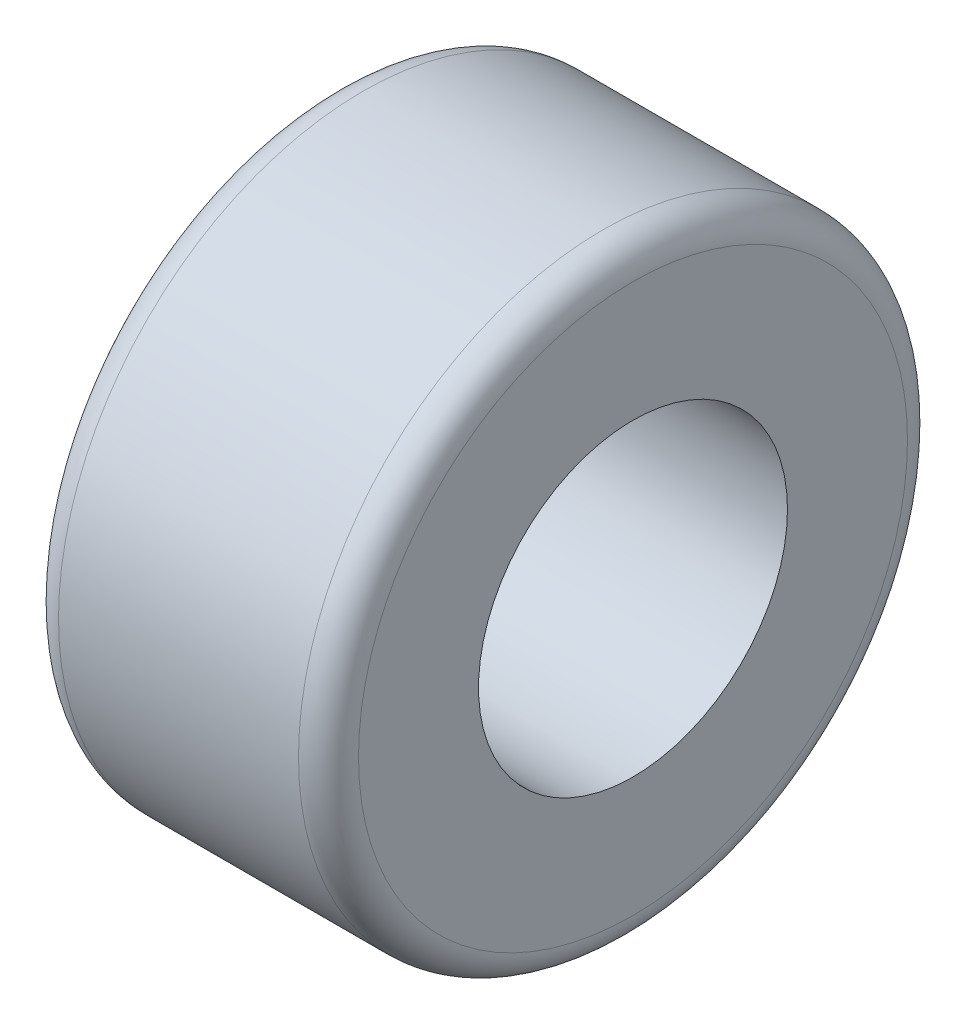
ISO-10303-21;
HEADER;
FILE_DESCRIPTION(('STEP AP214'),'2;1');
FILE_NAME('part.step','',(''),(''),'','','');
FILE_SCHEMA(('AUTOMOTIVE_DESIGN { 1 0 10303 214 1 1 1 1 }'));
ENDSEC;
DATA;
#1=APPLICATION_CONTEXT('core data for automotive mechanical design processes');
#2=APPLICATION_PROTOCOL_DEFINITION('international standard','automotive_design',2000,#1);
#3=PRODUCT_CONTEXT('',#1,'mechanical');
#4=PRODUCT('Part','Part','',(#3));
#5=PRODUCT_RELATED_PRODUCT_CATEGORY('part','',(#4));
#6=PRODUCT_DEFINITION_FORMATION('','',#4);
#7=PRODUCT_DEFINITION_CONTEXT('part definition',#1,'design');
#8=PRODUCT_DEFINITION('design','',#6,#7);
#9=PRODUCT_DEFINITION_SHAPE('','',#8);
#10=(LENGTH_UNIT() NAMED_UNIT(*) SI_UNIT(.MILLI.,.METRE.));
#11=(NAMED_UNIT(*) PLANE_ANGLE_UNIT() SI_UNIT($,.RADIAN.));
#12=(NAMED_UNIT(*) SI_UNIT($,.STERADIAN.) SOLID_ANGLE_UNIT());
#13=UNCERTAINTY_MEASURE_WITH_UNIT(LENGTH_MEASURE(1.E-05),#10,'distance_accuracy_value','');
#14=(GEOMETRIC_REPRESENTATION_CONTEXT(3) GLOBAL_UNCERTAINTY_ASSIGNED_CONTEXT((#13)) GLOBAL_UNIT_ASSIGNED_CONTEXT((#10,
#11,#12)) REPRESENTATION_CONTEXT('',''));
#15=CARTESIAN_POINT('',(0.,0.,0.));
#16=DIRECTION('',(0.,0.,1.));
#17=DIRECTION('',(1.,0.,0.));
#18=AXIS2_PLACEMENT_3D('',#15,#16,#17);
#19=CARTESIAN_POINT('',(10.,0.,0.));
#20=DIRECTION('',(1.,0.,0.));
#21=DIRECTION('',(0.,0.,-1.));
#22=AXIS2_PLACEMENT_3D('',#19,#20,#21);
#23=PLANE('',#22);
#24=CARTESIAN_POINT('',(10.,0.,0.));
#25=DIRECTION('',(1.,0.,0.));
#26=DIRECTION('',(0.,0.,-1.));
#27=AXIS2_PLACEMENT_3D('',#24,#25,#26);
#28=CIRCLE('',#27,9.15);
#29=CARTESIAN_POINT('',(10.,0.,-9.15));
#30=VERTEX_POINT('',#29);
#31=EDGE_CURVE('E10',#30,#30,#28,.T.);
#32=ORIENTED_EDGE('',*,*,#31,.T.);
#33=EDGE_LOOP('',(#32));
#34=FACE_BOUND('',#33,.T.);
#35=CARTESIAN_POINT('',(10.,0.,0.));
#36=DIRECTION('',(1.,0.,0.));
#37=DIRECTION('',(0.,0.,-1.));
#38=AXIS2_PLACEMENT_3D('',#35,#36,#37);
#39=CIRCLE('',#38,5.15);
#40=CARTESIAN_POINT('',(10.,0.,-5.15));
#41=VERTEX_POINT('',#40);
#42=EDGE_CURVE('E51',#41,#41,#39,.T.);
#43=ORIENTED_EDGE('',*,*,#42,.F.);
#44=EDGE_LOOP('',(#43));
#45=FACE_BOUND('',#44,.T.);
#46=ADVANCED_FACE('F31',(#34,#45),#23,.T.);
#47=CARTESIAN_POINT('',(0.,0.,0.));
#48=DIRECTION('',(1.,0.,0.));
#49=DIRECTION('',(0.,0.,-1.));
#50=AXIS2_PLACEMENT_3D('',#47,#48,#49);
#51=PLANE('',#50);
#52=CARTESIAN_POINT('',(0.,0.,0.));
#53=DIRECTION('',(1.,0.,0.));
#54=DIRECTION('',(0.,0.,-1.));
#55=AXIS2_PLACEMENT_3D('',#52,#53,#54);
#56=CIRCLE('',#55,9.15);
#57=CARTESIAN_POINT('',(0.,0.,-9.15));
#58=VERTEX_POINT('',#57);
#59=EDGE_CURVE('E38',#58,#58,#56,.F.);
#60=ORIENTED_EDGE('',*,*,#59,.T.);
#61=EDGE_LOOP('',(#60));
#62=FACE_BOUND('',#61,.T.);
#63=CARTESIAN_POINT('',(0.,0.,0.));
#64=DIRECTION('',(1.,0.,0.));
#65=DIRECTION('',(0.,0.,-1.));
#66=AXIS2_PLACEMENT_3D('',#63,#64,#65);
#67=CIRCLE('',#66,5.15);
#68=CARTESIAN_POINT('',(0.,0.,-5.15));
#69=VERTEX_POINT('',#68);
#70=EDGE_CURVE('E52',#69,#69,#67,.T.);
#71=ORIENTED_EDGE('',*,*,#70,.T.);
#72=EDGE_LOOP('',(#71));
#73=FACE_BOUND('',#72,.T.);
#74=ADVANCED_FACE('F62',(#62,#73),#51,.F.);
#75=CARTESIAN_POINT('',(10.,0.,0.));
#76=DIRECTION('',(-1.,0.,0.));
#77=DIRECTION('',(0.,0.,1.));
#78=AXIS2_PLACEMENT_3D('',#75,#76,#77);
#79=CYLINDRICAL_SURFACE('',#78,10.15);
#80=CARTESIAN_POINT('',(0.999999999999999,0.,0.));
#81=DIRECTION('',(1.,0.,0.));
#82=DIRECTION('',(0.,0.,-1.));
#83=AXIS2_PLACEMENT_3D('',#80,#81,#82);
#84=CIRCLE('',#83,10.15);
#85=CARTESIAN_POINT('',(0.999999999999999,0.,-10.15));
#86=VERTEX_POINT('',#85);
#87=EDGE_CURVE('E42',#86,#86,#84,.T.);
#88=ORIENTED_EDGE('',*,*,#87,.T.);
#89=EDGE_LOOP('',(#88));
#90=FACE_BOUND('',#89,.T.);
#91=CARTESIAN_POINT('',(9.,0.,0.));
#92=DIRECTION('',(1.,0.,0.));
#93=DIRECTION('',(0.,0.,-1.));
#94=AXIS2_PLACEMENT_3D('',#91,#92,#93);
#95=CIRCLE('',#94,10.15);
#96=CARTESIAN_POINT('',(9.,0.,-10.15));
#97=VERTEX_POINT('',#96);
#98=EDGE_CURVE('E46',#97,#97,#95,.F.);
#99=ORIENTED_EDGE('',*,*,#98,.T.);
#100=EDGE_LOOP('',(#99));
#101=FACE_BOUND('',#100,.T.);
#102=ADVANCED_FACE('F67',(#90,#101),#79,.T.);
#103=CARTESIAN_POINT('',(10.,0.,0.));
#104=DIRECTION('',(-1.,0.,0.));
#105=DIRECTION('',(0.,0.,1.));
#106=AXIS2_PLACEMENT_3D('',#103,#104,#105);
#107=CYLINDRICAL_SURFACE('',#106,5.15);
#108=ORIENTED_EDGE('',*,*,#42,.T.);
#109=EDGE_LOOP('',(#108));
#110=FACE_BOUND('',#109,.T.);
#111=ORIENTED_EDGE('',*,*,#70,.F.);
#112=EDGE_LOOP('',(#111));
#113=FACE_BOUND('',#112,.T.);
#114=ADVANCED_FACE('F58',(#110,#113),#107,.F.);
#115=CARTESIAN_POINT('',(0.999999999999999,0.,0.));
#116=DIRECTION('',(1.,0.,0.));
#117=DIRECTION('',(0.,0.,-1.));
#118=AXIS2_PLACEMENT_3D('',#115,#116,#117);
#119=TOROIDAL_SURFACE('',#118,9.15,1.);
#120=ORIENTED_EDGE('',*,*,#59,.F.);
#121=EDGE_LOOP('',(#120));
#122=FACE_BOUND('',#121,.T.);
#123=ORIENTED_EDGE('',*,*,#87,.F.);
#124=EDGE_LOOP('',(#123));
#125=FACE_BOUND('',#124,.T.);
#126=ADVANCED_FACE('F73',(#122,#125),#119,.T.);
#127=CARTESIAN_POINT('',(9.,0.,0.));
#128=DIRECTION('',(1.,0.,0.));
#129=DIRECTION('',(0.,0.,-1.));
#130=AXIS2_PLACEMENT_3D('',#127,#128,#129);
#131=TOROIDAL_SURFACE('',#130,9.15,1.);
#132=ORIENTED_EDGE('',*,*,#98,.F.);
#133=EDGE_LOOP('',(#132));
#134=FACE_BOUND('',#133,.T.);
#135=ORIENTED_EDGE('',*,*,#31,.F.);
#136=EDGE_LOOP('',(#135));
#137=FACE_BOUND('',#136,.T.);
#138=ADVANCED_FACE('F33',(#134,#137),#131,.T.);
#139=CLOSED_SHELL('',(#46,#74,#102,#114,#126,#138));
#140=MANIFOLD_SOLID_BREP('B2',#139);
#141=ADVANCED_BREP_SHAPE_REPRESENTATION('',(#18,#140),#14);
#142=SHAPE_DEFINITION_REPRESENTATION(#9,#141);
ENDSEC;
END-ISO-10303-21;
